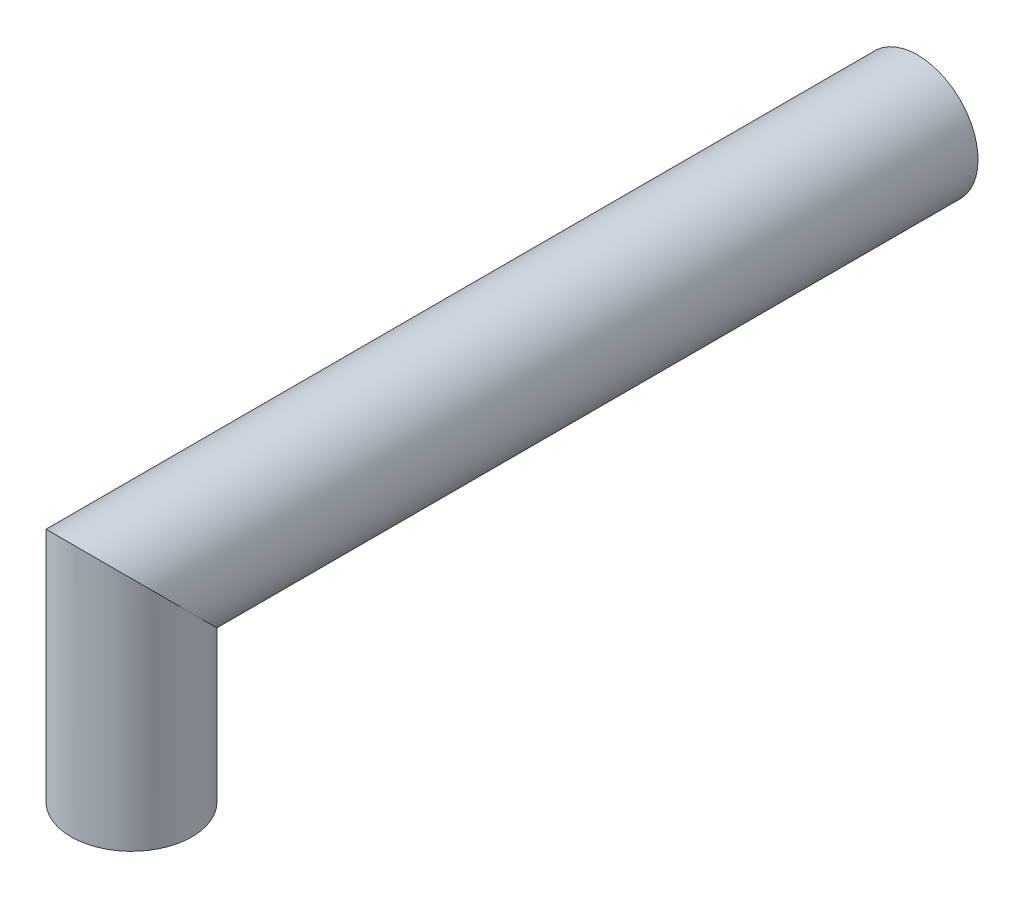
ISO-10303-21;
HEADER;
FILE_DESCRIPTION(('STEP AP214'),'2;1');
FILE_NAME('part.step','',(''),(''),'','','');
FILE_SCHEMA(('AUTOMOTIVE_DESIGN { 1 0 10303 214 1 1 1 1 }'));
ENDSEC;
DATA;
#1=APPLICATION_CONTEXT('core data for automotive mechanical design processes');
#2=APPLICATION_PROTOCOL_DEFINITION('international standard','automotive_design',2000,#1);
#3=PRODUCT_CONTEXT('',#1,'mechanical');
#4=PRODUCT('Part','Part','',(#3));
#5=PRODUCT_RELATED_PRODUCT_CATEGORY('part','',(#4));
#6=PRODUCT_DEFINITION_FORMATION('','',#4);
#7=PRODUCT_DEFINITION_CONTEXT('part definition',#1,'design');
#8=PRODUCT_DEFINITION('design','',#6,#7);
#9=PRODUCT_DEFINITION_SHAPE('','',#8);
#10=(LENGTH_UNIT() NAMED_UNIT(*) SI_UNIT(.MILLI.,.METRE.));
#11=(NAMED_UNIT(*) PLANE_ANGLE_UNIT() SI_UNIT($,.RADIAN.));
#12=(NAMED_UNIT(*) SI_UNIT($,.STERADIAN.) SOLID_ANGLE_UNIT());
#13=UNCERTAINTY_MEASURE_WITH_UNIT(LENGTH_MEASURE(1.E-05),#10,'distance_accuracy_value','');
#14=(GEOMETRIC_REPRESENTATION_CONTEXT(3) GLOBAL_UNCERTAINTY_ASSIGNED_CONTEXT((#13)) GLOBAL_UNIT_ASSIGNED_CONTEXT((#10,
#11,#12)) REPRESENTATION_CONTEXT('',''));
#15=CARTESIAN_POINT('',(0.,0.,0.));
#16=DIRECTION('',(0.,0.,1.));
#17=DIRECTION('',(1.,0.,0.));
#18=AXIS2_PLACEMENT_3D('',#15,#16,#17);
#19=CARTESIAN_POINT('',(0.,16.,-65.));
#20=DIRECTION('',(0.,0.,-1.));
#21=DIRECTION('',(0.,1.,0.));
#22=AXIS2_PLACEMENT_3D('',#19,#20,#21);
#23=PLANE('',#22);
#24=CARTESIAN_POINT('',(0.,16.,-65.));
#25=DIRECTION('',(0.,0.,-1.));
#26=DIRECTION('',(0.,1.,0.));
#27=AXIS2_PLACEMENT_3D('',#24,#25,#26);
#28=CIRCLE('',#27,5.);
#29=CARTESIAN_POINT('',(0.,21.,-65.));
#30=VERTEX_POINT('',#29);
#31=EDGE_CURVE('E35',#30,#30,#28,.T.);
#32=ORIENTED_EDGE('',*,*,#31,.T.);
#33=EDGE_LOOP('',(#32));
#34=FACE_BOUND('',#33,.T.);
#35=ADVANCED_FACE('F32',(#34),#23,.T.);
#36=CARTESIAN_POINT('',(0.,0.,0.));
#37=DIRECTION('',(0.,1.,0.));
#38=DIRECTION('',(0.,0.,1.));
#39=AXIS2_PLACEMENT_3D('',#36,#37,#38);
#40=PLANE('',#39);
#41=CARTESIAN_POINT('',(0.,0.,0.));
#42=DIRECTION('',(0.,1.,0.));
#43=DIRECTION('',(0.,0.,1.));
#44=AXIS2_PLACEMENT_3D('',#41,#42,#43);
#45=CIRCLE('',#44,5.);
#46=CARTESIAN_POINT('',(0.,0.,5.));
#47=VERTEX_POINT('',#46);
#48=EDGE_CURVE('E39',#47,#47,#45,.T.);
#49=ORIENTED_EDGE('',*,*,#48,.F.);
#50=EDGE_LOOP('',(#49));
#51=FACE_BOUND('',#50,.T.);
#52=ADVANCED_FACE('F53',(#51),#40,.F.);
#53=CARTESIAN_POINT('',(0.,16.,5.6));
#54=DIRECTION('',(0.,0.,-1.));
#55=DIRECTION('',(-1.,0.,0.));
#56=AXIS2_PLACEMENT_3D('',#53,#54,#55);
#57=CYLINDRICAL_SURFACE('',#56,5.);
#58=CARTESIAN_POINT('',(0.,16.,0.));
#59=DIRECTION('',(0.,0.707106781186548,-0.707106781186548));
#60=DIRECTION('',(0.,0.707106781186548,0.707106781186548));
#61=AXIS2_PLACEMENT_3D('',#58,#59,#60);
#62=ELLIPSE('',#61,7.07106781186548,5.);
#63=CARTESIAN_POINT('',(0.,21.,5.));
#64=VERTEX_POINT('',#63);
#65=EDGE_CURVE('E10',#64,#64,#62,.F.);
#66=ORIENTED_EDGE('',*,*,#65,.F.);
#67=EDGE_LOOP('',(#66));
#68=FACE_BOUND('',#67,.T.);
#69=ORIENTED_EDGE('',*,*,#31,.F.);
#70=EDGE_LOOP('',(#69));
#71=FACE_BOUND('',#70,.T.);
#72=ADVANCED_FACE('F50',(#68,#71),#57,.T.);
#73=CARTESIAN_POINT('',(0.,0.,0.));
#74=DIRECTION('',(0.,1.,0.));
#75=DIRECTION('',(0.,0.,1.));
#76=AXIS2_PLACEMENT_3D('',#73,#74,#75);
#77=CYLINDRICAL_SURFACE('',#76,5.);
#78=ORIENTED_EDGE('',*,*,#48,.T.);
#79=EDGE_LOOP('',(#78));
#80=FACE_BOUND('',#79,.T.);
#81=ORIENTED_EDGE('',*,*,#65,.T.);
#82=EDGE_LOOP('',(#81));
#83=FACE_BOUND('',#82,.T.);
#84=ADVANCED_FACE('F52',(#80,#83),#77,.T.);
#85=CLOSED_SHELL('',(#35,#52,#72,#84));
#86=MANIFOLD_SOLID_BREP('B2',#85);
#87=ADVANCED_BREP_SHAPE_REPRESENTATION('',(#18,#86),#14);
#88=SHAPE_DEFINITION_REPRESENTATION(#9,#87);
ENDSEC;
END-ISO-10303-21;
